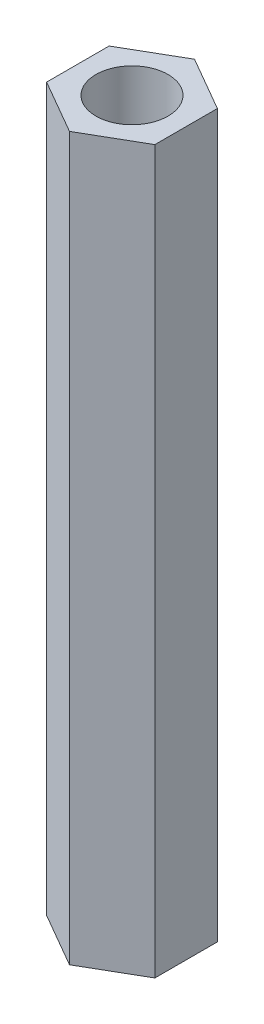
ISO-10303-21;
HEADER;
FILE_DESCRIPTION(('STEP AP214'),'2;1');
FILE_NAME('part.step','',(''),(''),'','','');
FILE_SCHEMA(('AUTOMOTIVE_DESIGN { 1 0 10303 214 1 1 1 1 }'));
ENDSEC;
DATA;
#1=APPLICATION_CONTEXT('core data for automotive mechanical design processes');
#2=APPLICATION_PROTOCOL_DEFINITION('international standard','automotive_design',2000,#1);
#3=PRODUCT_CONTEXT('',#1,'mechanical');
#4=PRODUCT('Part','Part','',(#3));
#5=PRODUCT_RELATED_PRODUCT_CATEGORY('part','',(#4));
#6=PRODUCT_DEFINITION_FORMATION('','',#4);
#7=PRODUCT_DEFINITION_CONTEXT('part definition',#1,'design');
#8=PRODUCT_DEFINITION('design','',#6,#7);
#9=PRODUCT_DEFINITION_SHAPE('','',#8);
#10=(LENGTH_UNIT() NAMED_UNIT(*) SI_UNIT(.MILLI.,.METRE.));
#11=(NAMED_UNIT(*) PLANE_ANGLE_UNIT() SI_UNIT($,.RADIAN.));
#12=(NAMED_UNIT(*) SI_UNIT($,.STERADIAN.) SOLID_ANGLE_UNIT());
#13=UNCERTAINTY_MEASURE_WITH_UNIT(LENGTH_MEASURE(1.E-05),#10,'distance_accuracy_value','');
#14=(GEOMETRIC_REPRESENTATION_CONTEXT(3) GLOBAL_UNCERTAINTY_ASSIGNED_CONTEXT((#13)) GLOBAL_UNIT_ASSIGNED_CONTEXT((#10,
#11,#12)) REPRESENTATION_CONTEXT('',''));
#15=CARTESIAN_POINT('',(0.,0.,0.));
#16=DIRECTION('',(0.,0.,1.));
#17=DIRECTION('',(1.,0.,0.));
#18=AXIS2_PLACEMENT_3D('',#15,#16,#17);
#19=CARTESIAN_POINT('',(0.,20.,0.));
#20=DIRECTION('',(0.,1.,0.));
#21=DIRECTION('',(0.,0.,1.));
#22=AXIS2_PLACEMENT_3D('',#19,#20,#21);
#23=PLANE('',#22);
#24=DIRECTION('',(0.866025403784442,0.,0.499999999999995));
#25=VECTOR('',#24,1.);
#26=CARTESIAN_POINT('',(-1.49999999999999,20.,0.866025403784455));
#27=LINE('',#26,#25);
#28=CARTESIAN_POINT('',(-1.49999999999999,20.,0.866025403784455));
#29=VERTEX_POINT('',#28);
#30=CARTESIAN_POINT('',(0.,20.,1.73205080756888));
#31=VERTEX_POINT('',#30);
#32=EDGE_CURVE('E148',#29,#31,#27,.T.);
#33=ORIENTED_EDGE('',*,*,#32,.T.);
#34=DIRECTION('',(0.866025403784438,0.,-0.500000000000001));
#35=VECTOR('',#34,1.);
#36=CARTESIAN_POINT('',(0.,20.,1.73205080756888));
#37=LINE('',#36,#35);
#38=CARTESIAN_POINT('',(1.5,20.,0.866025403784434));
#39=VERTEX_POINT('',#38);
#40=EDGE_CURVE('E96',#31,#39,#37,.T.);
#41=ORIENTED_EDGE('',*,*,#40,.T.);
#42=DIRECTION('',(0.,0.,-1.));
#43=VECTOR('',#42,1.);
#44=CARTESIAN_POINT('',(1.5,20.,0.866025403784434));
#45=LINE('',#44,#43);
#46=CARTESIAN_POINT('',(1.49999999999999,20.,-0.866025403784445));
#47=VERTEX_POINT('',#46);
#48=EDGE_CURVE('E109',#39,#47,#45,.T.);
#49=ORIENTED_EDGE('',*,*,#48,.T.);
#50=DIRECTION('',(-0.866025403784442,0.,-0.499999999999995));
#51=VECTOR('',#50,1.);
#52=CARTESIAN_POINT('',(1.49999999999999,20.,-0.866025403784445));
#53=LINE('',#52,#51);
#54=CARTESIAN_POINT('',(0.,20.,-1.73205080756887));
#55=VERTEX_POINT('',#54);
#56=EDGE_CURVE('E103',#47,#55,#53,.T.);
#57=ORIENTED_EDGE('',*,*,#56,.T.);
#58=DIRECTION('',(-0.866025403784435,0.,0.500000000000007));
#59=VECTOR('',#58,1.);
#60=CARTESIAN_POINT('',(0.,20.,-1.73205080756887));
#61=LINE('',#60,#59);
#62=CARTESIAN_POINT('',(-1.50000000000001,20.,-0.866025403784424));
#63=VERTEX_POINT('',#62);
#64=EDGE_CURVE('E107',#55,#63,#61,.T.);
#65=ORIENTED_EDGE('',*,*,#64,.T.);
#66=DIRECTION('',(0.,0.,1.));
#67=VECTOR('',#66,1.);
#68=CARTESIAN_POINT('',(-1.50000000000001,20.,-0.866025403784424));
#69=LINE('',#68,#67);
#70=EDGE_CURVE('E59',#63,#29,#69,.T.);
#71=ORIENTED_EDGE('',*,*,#70,.T.);
#72=EDGE_LOOP('',(#33,#41,#49,#57,#65,#71));
#73=FACE_BOUND('',#72,.T.);
#74=CARTESIAN_POINT('',(0.,20.,0.));
#75=DIRECTION('',(0.,1.,0.));
#76=DIRECTION('',(0.,0.,1.));
#77=AXIS2_PLACEMENT_3D('',#74,#75,#76);
#78=CIRCLE('',#77,1.);
#79=CARTESIAN_POINT('',(0.,20.,1.));
#80=VERTEX_POINT('',#79);
#81=EDGE_CURVE('E136',#80,#80,#78,.T.);
#82=ORIENTED_EDGE('',*,*,#81,.F.);
#83=EDGE_LOOP('',(#82));
#84=FACE_BOUND('',#83,.T.);
#85=ADVANCED_FACE('F41',(#73,#84),#23,.T.);
#86=CARTESIAN_POINT('',(0.,0.,0.));
#87=DIRECTION('',(0.,1.,0.));
#88=DIRECTION('',(0.,0.,1.));
#89=AXIS2_PLACEMENT_3D('',#86,#87,#88);
#90=PLANE('',#89);
#91=DIRECTION('',(0.866025403784442,0.,0.499999999999995));
#92=VECTOR('',#91,1.);
#93=CARTESIAN_POINT('',(-1.49999999999999,0.,0.866025403784455));
#94=LINE('',#93,#92);
#95=CARTESIAN_POINT('',(-1.49999999999999,0.,0.866025403784455));
#96=VERTEX_POINT('',#95);
#97=CARTESIAN_POINT('',(0.,0.,1.73205080756888));
#98=VERTEX_POINT('',#97);
#99=EDGE_CURVE('E131',#96,#98,#94,.T.);
#100=ORIENTED_EDGE('',*,*,#99,.F.);
#101=DIRECTION('',(0.,0.,1.));
#102=VECTOR('',#101,1.);
#103=CARTESIAN_POINT('',(-1.50000000000001,0.,-0.866025403784424));
#104=LINE('',#103,#102);
#105=CARTESIAN_POINT('',(-1.50000000000001,0.,-0.866025403784424));
#106=VERTEX_POINT('',#105);
#107=EDGE_CURVE('E88',#106,#96,#104,.T.);
#108=ORIENTED_EDGE('',*,*,#107,.F.);
#109=DIRECTION('',(-0.866025403784435,0.,0.500000000000007));
#110=VECTOR('',#109,1.);
#111=CARTESIAN_POINT('',(0.,0.,-1.73205080756887));
#112=LINE('',#111,#110);
#113=CARTESIAN_POINT('',(0.,0.,-1.73205080756887));
#114=VERTEX_POINT('',#113);
#115=EDGE_CURVE('E82',#114,#106,#112,.T.);
#116=ORIENTED_EDGE('',*,*,#115,.F.);
#117=DIRECTION('',(-0.866025403784442,0.,-0.499999999999995));
#118=VECTOR('',#117,1.);
#119=CARTESIAN_POINT('',(1.49999999999999,0.,-0.866025403784445));
#120=LINE('',#119,#118);
#121=CARTESIAN_POINT('',(1.49999999999999,0.,-0.866025403784445));
#122=VERTEX_POINT('',#121);
#123=EDGE_CURVE('E118',#122,#114,#120,.T.);
#124=ORIENTED_EDGE('',*,*,#123,.F.);
#125=DIRECTION('',(0.,0.,-1.));
#126=VECTOR('',#125,1.);
#127=CARTESIAN_POINT('',(1.5,0.,0.866025403784434));
#128=LINE('',#127,#126);
#129=CARTESIAN_POINT('',(1.5,0.,0.866025403784434));
#130=VERTEX_POINT('',#129);
#131=EDGE_CURVE('E139',#130,#122,#128,.T.);
#132=ORIENTED_EDGE('',*,*,#131,.F.);
#133=DIRECTION('',(0.866025403784438,0.,-0.500000000000001));
#134=VECTOR('',#133,1.);
#135=CARTESIAN_POINT('',(0.,0.,1.73205080756888));
#136=LINE('',#135,#134);
#137=EDGE_CURVE('E135',#98,#130,#136,.T.);
#138=ORIENTED_EDGE('',*,*,#137,.F.);
#139=EDGE_LOOP('',(#100,#108,#116,#124,#132,#138));
#140=FACE_BOUND('',#139,.T.);
#141=CARTESIAN_POINT('',(0.,0.,0.));
#142=DIRECTION('',(0.,1.,0.));
#143=DIRECTION('',(0.,0.,1.));
#144=AXIS2_PLACEMENT_3D('',#141,#142,#143);
#145=CIRCLE('',#144,1.);
#146=CARTESIAN_POINT('',(0.,0.,1.));
#147=VERTEX_POINT('',#146);
#148=EDGE_CURVE('E245',#147,#147,#145,.T.);
#149=ORIENTED_EDGE('',*,*,#148,.T.);
#150=EDGE_LOOP('',(#149));
#151=FACE_BOUND('',#150,.T.);
#152=ADVANCED_FACE('F161',(#140,#151),#90,.F.);
#153=CARTESIAN_POINT('',(-1.49999999999999,20.,0.866025403784455));
#154=DIRECTION('',(0.499999999999995,0.,-0.866025403784442));
#155=DIRECTION('',(-0.866025403784442,0.,-0.499999999999995));
#156=AXIS2_PLACEMENT_3D('',#153,#154,#155);
#157=PLANE('',#156);
#158=ORIENTED_EDGE('',*,*,#99,.T.);
#159=DIRECTION('',(0.,-1.,0.));
#160=VECTOR('',#159,1.);
#161=CARTESIAN_POINT('',(0.,20.,1.73205080756888));
#162=LINE('',#161,#160);
#163=EDGE_CURVE('E11',#31,#98,#162,.T.);
#164=ORIENTED_EDGE('',*,*,#163,.F.);
#165=ORIENTED_EDGE('',*,*,#32,.F.);
#166=DIRECTION('',(0.,-1.,0.));
#167=VECTOR('',#166,1.);
#168=CARTESIAN_POINT('',(-1.49999999999999,20.,0.866025403784455));
#169=LINE('',#168,#167);
#170=EDGE_CURVE('E127',#29,#96,#169,.T.);
#171=ORIENTED_EDGE('',*,*,#170,.T.);
#172=EDGE_LOOP('',(#158,#164,#165,#171));
#173=FACE_BOUND('',#172,.T.);
#174=ADVANCED_FACE('F43',(#173),#157,.F.);
#175=CARTESIAN_POINT('',(0.,20.,1.73205080756888));
#176=DIRECTION('',(-0.500000000000001,0.,-0.866025403784438));
#177=DIRECTION('',(-0.866025403784438,0.,0.500000000000001));
#178=AXIS2_PLACEMENT_3D('',#175,#176,#177);
#179=PLANE('',#178);
#180=ORIENTED_EDGE('',*,*,#137,.T.);
#181=DIRECTION('',(0.,-1.,0.));
#182=VECTOR('',#181,1.);
#183=CARTESIAN_POINT('',(1.5,20.,0.866025403784434));
#184=LINE('',#183,#182);
#185=EDGE_CURVE('E51',#39,#130,#184,.T.);
#186=ORIENTED_EDGE('',*,*,#185,.F.);
#187=ORIENTED_EDGE('',*,*,#40,.F.);
#188=ORIENTED_EDGE('',*,*,#163,.T.);
#189=EDGE_LOOP('',(#180,#186,#187,#188));
#190=FACE_BOUND('',#189,.T.);
#191=ADVANCED_FACE('F186',(#190),#179,.F.);
#192=CARTESIAN_POINT('',(1.5,20.,0.866025403784434));
#193=DIRECTION('',(-1.,0.,0.));
#194=DIRECTION('',(0.,0.,1.));
#195=AXIS2_PLACEMENT_3D('',#192,#193,#194);
#196=PLANE('',#195);
#197=ORIENTED_EDGE('',*,*,#131,.T.);
#198=DIRECTION('',(0.,-1.,0.));
#199=VECTOR('',#198,1.);
#200=CARTESIAN_POINT('',(1.49999999999999,20.,-0.866025403784445));
#201=LINE('',#200,#199);
#202=EDGE_CURVE('E120',#47,#122,#201,.T.);
#203=ORIENTED_EDGE('',*,*,#202,.F.);
#204=ORIENTED_EDGE('',*,*,#48,.F.);
#205=ORIENTED_EDGE('',*,*,#185,.T.);
#206=EDGE_LOOP('',(#197,#203,#204,#205));
#207=FACE_BOUND('',#206,.T.);
#208=ADVANCED_FACE('F158',(#207),#196,.F.);
#209=CARTESIAN_POINT('',(1.49999999999999,20.,-0.866025403784445));
#210=DIRECTION('',(-0.499999999999995,0.,0.866025403784442));
#211=DIRECTION('',(0.866025403784442,0.,0.499999999999995));
#212=AXIS2_PLACEMENT_3D('',#209,#210,#211);
#213=PLANE('',#212);
#214=ORIENTED_EDGE('',*,*,#123,.T.);
#215=DIRECTION('',(0.,-1.,0.));
#216=VECTOR('',#215,1.);
#217=CARTESIAN_POINT('',(0.,20.,-1.73205080756887));
#218=LINE('',#217,#216);
#219=EDGE_CURVE('E115',#55,#114,#218,.T.);
#220=ORIENTED_EDGE('',*,*,#219,.F.);
#221=ORIENTED_EDGE('',*,*,#56,.F.);
#222=ORIENTED_EDGE('',*,*,#202,.T.);
#223=EDGE_LOOP('',(#214,#220,#221,#222));
#224=FACE_BOUND('',#223,.T.);
#225=ADVANCED_FACE('F116',(#224),#213,.F.);
#226=CARTESIAN_POINT('',(0.,20.,-1.73205080756887));
#227=DIRECTION('',(0.500000000000007,0.,0.866025403784435));
#228=DIRECTION('',(0.866025403784435,0.,-0.500000000000007));
#229=AXIS2_PLACEMENT_3D('',#226,#227,#228);
#230=PLANE('',#229);
#231=ORIENTED_EDGE('',*,*,#115,.T.);
#232=DIRECTION('',(0.,-1.,0.));
#233=VECTOR('',#232,1.);
#234=CARTESIAN_POINT('',(-1.50000000000001,20.,-0.866025403784424));
#235=LINE('',#234,#233);
#236=EDGE_CURVE('E121',#63,#106,#235,.T.);
#237=ORIENTED_EDGE('',*,*,#236,.F.);
#238=ORIENTED_EDGE('',*,*,#64,.F.);
#239=ORIENTED_EDGE('',*,*,#219,.T.);
#240=EDGE_LOOP('',(#231,#237,#238,#239));
#241=FACE_BOUND('',#240,.T.);
#242=ADVANCED_FACE('F123',(#241),#230,.F.);
#243=CARTESIAN_POINT('',(-1.50000000000001,20.,-0.866025403784424));
#244=DIRECTION('',(1.,0.,0.));
#245=DIRECTION('',(0.,0.,-1.));
#246=AXIS2_PLACEMENT_3D('',#243,#244,#245);
#247=PLANE('',#246);
#248=ORIENTED_EDGE('',*,*,#107,.T.);
#249=ORIENTED_EDGE('',*,*,#170,.F.);
#250=ORIENTED_EDGE('',*,*,#70,.F.);
#251=ORIENTED_EDGE('',*,*,#236,.T.);
#252=EDGE_LOOP('',(#248,#249,#250,#251));
#253=FACE_BOUND('',#252,.T.);
#254=ADVANCED_FACE('F166',(#253),#247,.F.);
#255=CARTESIAN_POINT('',(0.,20.,0.));
#256=DIRECTION('',(0.,-1.,0.));
#257=DIRECTION('',(0.,0.,-1.));
#258=AXIS2_PLACEMENT_3D('',#255,#256,#257);
#259=CYLINDRICAL_SURFACE('',#258,1.);
#260=ORIENTED_EDGE('',*,*,#81,.T.);
#261=EDGE_LOOP('',(#260));
#262=FACE_BOUND('',#261,.T.);
#263=ORIENTED_EDGE('',*,*,#148,.F.);
#264=EDGE_LOOP('',(#263));
#265=FACE_BOUND('',#264,.T.);
#266=ADVANCED_FACE('F168',(#262,#265),#259,.F.);
#267=CLOSED_SHELL('',(#85,#152,#174,#191,#208,#225,#242,#254,#266));
#268=MANIFOLD_SOLID_BREP('B2',#267);
#269=ADVANCED_BREP_SHAPE_REPRESENTATION('',(#18,#268),#14);
#270=SHAPE_DEFINITION_REPRESENTATION(#9,#269);
ENDSEC;
END-ISO-10303-21;
